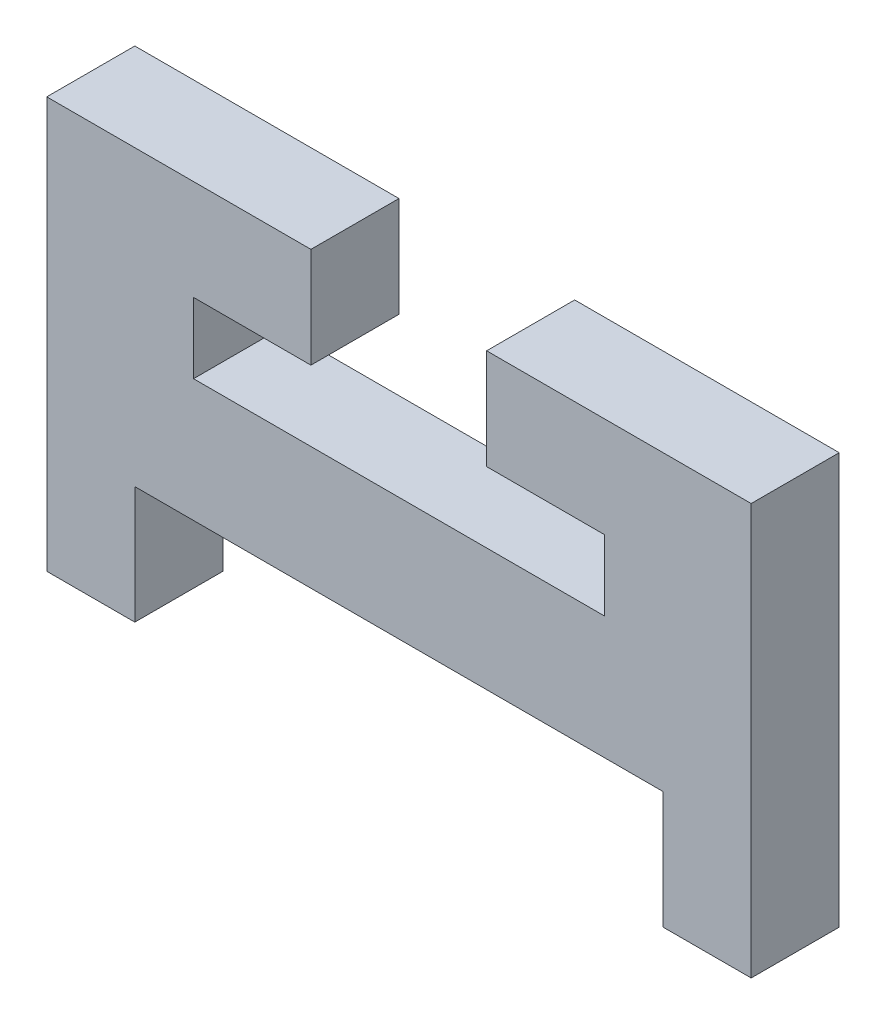
ISO-10303-21;
HEADER;
FILE_DESCRIPTION(('STEP AP214'),'2;1');
FILE_NAME('part.step','',(''),(''),'','','');
FILE_SCHEMA(('AUTOMOTIVE_DESIGN { 1 0 10303 214 1 1 1 1 }'));
ENDSEC;
DATA;
#1=APPLICATION_CONTEXT('core data for automotive mechanical design processes');
#2=APPLICATION_PROTOCOL_DEFINITION('international standard','automotive_design',2000,#1);
#3=PRODUCT_CONTEXT('',#1,'mechanical');
#4=PRODUCT('Part','Part','',(#3));
#5=PRODUCT_RELATED_PRODUCT_CATEGORY('part','',(#4));
#6=PRODUCT_DEFINITION_FORMATION('','',#4);
#7=PRODUCT_DEFINITION_CONTEXT('part definition',#1,'design');
#8=PRODUCT_DEFINITION('design','',#6,#7);
#9=PRODUCT_DEFINITION_SHAPE('','',#8);
#10=(LENGTH_UNIT() NAMED_UNIT(*) SI_UNIT(.MILLI.,.METRE.));
#11=(NAMED_UNIT(*) PLANE_ANGLE_UNIT() SI_UNIT($,.RADIAN.));
#12=(NAMED_UNIT(*) SI_UNIT($,.STERADIAN.) SOLID_ANGLE_UNIT());
#13=UNCERTAINTY_MEASURE_WITH_UNIT(LENGTH_MEASURE(1.E-05),#10,'distance_accuracy_value','');
#14=(GEOMETRIC_REPRESENTATION_CONTEXT(3) GLOBAL_UNCERTAINTY_ASSIGNED_CONTEXT((#13)) GLOBAL_UNIT_ASSIGNED_CONTEXT((#10,
#11,#12)) REPRESENTATION_CONTEXT('',''));
#15=CARTESIAN_POINT('',(0.,0.,0.));
#16=DIRECTION('',(0.,0.,1.));
#17=DIRECTION('',(1.,0.,0.));
#18=AXIS2_PLACEMENT_3D('',#15,#16,#17);
#19=CARTESIAN_POINT('',(33.6,16.0826832944775,3.));
#20=DIRECTION('',(0.,-1.,0.));
#21=DIRECTION('',(0.,0.,-1.));
#22=AXIS2_PLACEMENT_3D('',#19,#20,#21);
#23=PLANE('',#22);
#24=DIRECTION('',(-1.,0.,0.));
#25=VECTOR('',#24,1.);
#26=CARTESIAN_POINT('',(33.6,16.0826832944775,0.));
#27=LINE('',#26,#25);
#28=CARTESIAN_POINT('',(40.1,16.0826832944775,0.));
#29=VERTEX_POINT('',#28);
#30=CARTESIAN_POINT('',(26.1,16.0826832944775,0.));
#31=VERTEX_POINT('',#30);
#32=EDGE_CURVE('E109',#29,#31,#27,.T.);
#33=ORIENTED_EDGE('',*,*,#32,.T.);
#34=DIRECTION('',(0.,0.,-1.));
#35=VECTOR('',#34,1.);
#36=CARTESIAN_POINT('',(26.1,16.0826832944775,3.));
#37=LINE('',#36,#35);
#38=CARTESIAN_POINT('',(26.1,16.0826832944775,3.));
#39=VERTEX_POINT('',#38);
#40=EDGE_CURVE('E11',#39,#31,#37,.T.);
#41=ORIENTED_EDGE('',*,*,#40,.F.);
#42=DIRECTION('',(-1.,0.,0.));
#43=VECTOR('',#42,1.);
#44=CARTESIAN_POINT('',(40.1,16.0826832944775,3.));
#45=LINE('',#44,#43);
#46=CARTESIAN_POINT('',(40.1,16.0826832944775,3.));
#47=VERTEX_POINT('',#46);
#48=EDGE_CURVE('E115',#47,#39,#45,.T.);
#49=ORIENTED_EDGE('',*,*,#48,.F.);
#50=DIRECTION('',(0.,0.,-1.));
#51=VECTOR('',#50,1.);
#52=CARTESIAN_POINT('',(40.1,16.0826832944775,3.));
#53=LINE('',#52,#51);
#54=EDGE_CURVE('E173',#47,#29,#53,.T.);
#55=ORIENTED_EDGE('',*,*,#54,.T.);
#56=EDGE_LOOP('',(#33,#41,#49,#55));
#57=FACE_BOUND('',#56,.T.);
#58=ADVANCED_FACE('F33',(#57),#23,.F.);
#59=CARTESIAN_POINT('',(26.1,16.0826832944775,3.));
#60=DIRECTION('',(-1.,0.,0.));
#61=DIRECTION('',(0.,0.,1.));
#62=AXIS2_PLACEMENT_3D('',#59,#60,#61);
#63=PLANE('',#62);
#64=DIRECTION('',(0.,1.,0.));
#65=VECTOR('',#64,1.);
#66=CARTESIAN_POINT('',(26.1,16.0826832944775,0.));
#67=LINE('',#66,#65);
#68=CARTESIAN_POINT('',(26.1,18.4826832944775,0.));
#69=VERTEX_POINT('',#68);
#70=EDGE_CURVE('E178',#31,#69,#67,.T.);
#71=ORIENTED_EDGE('',*,*,#70,.T.);
#72=DIRECTION('',(0.,0.,-1.));
#73=VECTOR('',#72,1.);
#74=CARTESIAN_POINT('',(26.1,18.4826832944775,3.));
#75=LINE('',#74,#73);
#76=CARTESIAN_POINT('',(26.1,18.4826832944775,3.));
#77=VERTEX_POINT('',#76);
#78=EDGE_CURVE('E41',#77,#69,#75,.T.);
#79=ORIENTED_EDGE('',*,*,#78,.F.);
#80=DIRECTION('',(0.,1.,0.));
#81=VECTOR('',#80,1.);
#82=CARTESIAN_POINT('',(26.1,16.0826832944775,3.));
#83=LINE('',#82,#81);
#84=EDGE_CURVE('E294',#39,#77,#83,.T.);
#85=ORIENTED_EDGE('',*,*,#84,.F.);
#86=ORIENTED_EDGE('',*,*,#40,.T.);
#87=EDGE_LOOP('',(#71,#79,#85,#86));
#88=FACE_BOUND('',#87,.T.);
#89=ADVANCED_FACE('F297',(#88),#63,.F.);
#90=CARTESIAN_POINT('',(26.1,18.4826832944775,3.));
#91=DIRECTION('',(0.,1.,0.));
#92=DIRECTION('',(0.,0.,1.));
#93=AXIS2_PLACEMENT_3D('',#90,#91,#92);
#94=PLANE('',#93);
#95=DIRECTION('',(1.,0.,0.));
#96=VECTOR('',#95,1.);
#97=CARTESIAN_POINT('',(26.1,18.4826832944775,0.));
#98=LINE('',#97,#96);
#99=CARTESIAN_POINT('',(30.1,18.4826832944775,0.));
#100=VERTEX_POINT('',#99);
#101=EDGE_CURVE('E180',#69,#100,#98,.T.);
#102=ORIENTED_EDGE('',*,*,#101,.T.);
#103=DIRECTION('',(0.,0.,-1.));
#104=VECTOR('',#103,1.);
#105=CARTESIAN_POINT('',(30.1,18.4826832944775,3.));
#106=LINE('',#105,#104);
#107=CARTESIAN_POINT('',(30.1,18.4826832944775,3.));
#108=VERTEX_POINT('',#107);
#109=EDGE_CURVE('E237',#108,#100,#106,.T.);
#110=ORIENTED_EDGE('',*,*,#109,.F.);
#111=DIRECTION('',(1.,0.,0.));
#112=VECTOR('',#111,1.);
#113=CARTESIAN_POINT('',(26.1,18.4826832944775,3.));
#114=LINE('',#113,#112);
#115=EDGE_CURVE('E246',#77,#108,#114,.T.);
#116=ORIENTED_EDGE('',*,*,#115,.F.);
#117=ORIENTED_EDGE('',*,*,#78,.T.);
#118=EDGE_LOOP('',(#102,#110,#116,#117));
#119=FACE_BOUND('',#118,.T.);
#120=ADVANCED_FACE('F244',(#119),#94,.F.);
#121=CARTESIAN_POINT('',(30.1,18.4826832944775,3.));
#122=DIRECTION('',(-1.,0.,0.));
#123=DIRECTION('',(0.,0.,1.));
#124=AXIS2_PLACEMENT_3D('',#121,#122,#123);
#125=PLANE('',#124);
#126=DIRECTION('',(0.,1.,0.));
#127=VECTOR('',#126,1.);
#128=CARTESIAN_POINT('',(30.1,18.4826832944775,0.));
#129=LINE('',#128,#127);
#130=CARTESIAN_POINT('',(30.1,21.9,0.));
#131=VERTEX_POINT('',#130);
#132=EDGE_CURVE('E182',#100,#131,#129,.T.);
#133=ORIENTED_EDGE('',*,*,#132,.T.);
#134=DIRECTION('',(0.,0.,-1.));
#135=VECTOR('',#134,1.);
#136=CARTESIAN_POINT('',(30.1,21.9,3.));
#137=LINE('',#136,#135);
#138=CARTESIAN_POINT('',(30.1,21.9,3.));
#139=VERTEX_POINT('',#138);
#140=EDGE_CURVE('E234',#139,#131,#137,.T.);
#141=ORIENTED_EDGE('',*,*,#140,.F.);
#142=DIRECTION('',(0.,1.,0.));
#143=VECTOR('',#142,1.);
#144=CARTESIAN_POINT('',(30.1,18.4826832944775,3.));
#145=LINE('',#144,#143);
#146=EDGE_CURVE('E264',#108,#139,#145,.T.);
#147=ORIENTED_EDGE('',*,*,#146,.F.);
#148=ORIENTED_EDGE('',*,*,#109,.T.);
#149=EDGE_LOOP('',(#133,#141,#147,#148));
#150=FACE_BOUND('',#149,.T.);
#151=ADVANCED_FACE('F255',(#150),#125,.F.);
#152=CARTESIAN_POINT('',(30.1,21.9,3.));
#153=DIRECTION('',(0.,-1.,0.));
#154=DIRECTION('',(0.,0.,-1.));
#155=AXIS2_PLACEMENT_3D('',#152,#153,#154);
#156=PLANE('',#155);
#157=DIRECTION('',(-1.,0.,0.));
#158=VECTOR('',#157,1.);
#159=CARTESIAN_POINT('',(30.1,21.9,0.));
#160=LINE('',#159,#158);
#161=CARTESIAN_POINT('',(21.1,21.9,0.));
#162=VERTEX_POINT('',#161);
#163=EDGE_CURVE('E184',#131,#162,#160,.T.);
#164=ORIENTED_EDGE('',*,*,#163,.T.);
#165=DIRECTION('',(0.,0.,-1.));
#166=VECTOR('',#165,1.);
#167=CARTESIAN_POINT('',(21.1,21.9,3.));
#168=LINE('',#167,#166);
#169=CARTESIAN_POINT('',(21.1,21.9,3.));
#170=VERTEX_POINT('',#169);
#171=EDGE_CURVE('E231',#170,#162,#168,.T.);
#172=ORIENTED_EDGE('',*,*,#171,.F.);
#173=DIRECTION('',(-1.,0.,0.));
#174=VECTOR('',#173,1.);
#175=CARTESIAN_POINT('',(30.1,21.9,3.));
#176=LINE('',#175,#174);
#177=EDGE_CURVE('E261',#139,#170,#176,.T.);
#178=ORIENTED_EDGE('',*,*,#177,.F.);
#179=ORIENTED_EDGE('',*,*,#140,.T.);
#180=EDGE_LOOP('',(#164,#172,#178,#179));
#181=FACE_BOUND('',#180,.T.);
#182=ADVANCED_FACE('F259',(#181),#156,.F.);
#183=CARTESIAN_POINT('',(21.1,21.9,3.));
#184=DIRECTION('',(1.,0.,0.));
#185=DIRECTION('',(0.,0.,-1.));
#186=AXIS2_PLACEMENT_3D('',#183,#184,#185);
#187=PLANE('',#186);
#188=DIRECTION('',(0.,-1.,0.));
#189=VECTOR('',#188,1.);
#190=CARTESIAN_POINT('',(21.1,21.9,0.));
#191=LINE('',#190,#189);
#192=CARTESIAN_POINT('',(21.1,7.90000000000001,0.));
#193=VERTEX_POINT('',#192);
#194=EDGE_CURVE('E186',#162,#193,#191,.T.);
#195=ORIENTED_EDGE('',*,*,#194,.T.);
#196=DIRECTION('',(0.,0.,-1.));
#197=VECTOR('',#196,1.);
#198=CARTESIAN_POINT('',(21.1,7.90000000000001,3.));
#199=LINE('',#198,#197);
#200=CARTESIAN_POINT('',(21.1,7.90000000000001,3.));
#201=VERTEX_POINT('',#200);
#202=EDGE_CURVE('E228',#201,#193,#199,.T.);
#203=ORIENTED_EDGE('',*,*,#202,.F.);
#204=DIRECTION('',(0.,-1.,0.));
#205=VECTOR('',#204,1.);
#206=CARTESIAN_POINT('',(21.1,21.9,3.));
#207=LINE('',#206,#205);
#208=EDGE_CURVE('E263',#170,#201,#207,.T.);
#209=ORIENTED_EDGE('',*,*,#208,.F.);
#210=ORIENTED_EDGE('',*,*,#171,.T.);
#211=EDGE_LOOP('',(#195,#203,#209,#210));
#212=FACE_BOUND('',#211,.T.);
#213=ADVANCED_FACE('F309',(#212),#187,.F.);
#214=CARTESIAN_POINT('',(21.1,7.90000000000001,3.));
#215=DIRECTION('',(0.,1.,0.));
#216=DIRECTION('',(0.,0.,1.));
#217=AXIS2_PLACEMENT_3D('',#214,#215,#216);
#218=PLANE('',#217);
#219=DIRECTION('',(1.,0.,0.));
#220=VECTOR('',#219,1.);
#221=CARTESIAN_POINT('',(21.1,7.90000000000001,0.));
#222=LINE('',#221,#220);
#223=CARTESIAN_POINT('',(24.1,7.90000000000001,0.));
#224=VERTEX_POINT('',#223);
#225=EDGE_CURVE('E188',#193,#224,#222,.T.);
#226=ORIENTED_EDGE('',*,*,#225,.T.);
#227=DIRECTION('',(0.,0.,-1.));
#228=VECTOR('',#227,1.);
#229=CARTESIAN_POINT('',(24.1,7.90000000000001,3.));
#230=LINE('',#229,#228);
#231=CARTESIAN_POINT('',(24.1,7.90000000000001,3.));
#232=VERTEX_POINT('',#231);
#233=EDGE_CURVE('E225',#232,#224,#230,.T.);
#234=ORIENTED_EDGE('',*,*,#233,.F.);
#235=DIRECTION('',(1.,0.,0.));
#236=VECTOR('',#235,1.);
#237=CARTESIAN_POINT('',(21.1,7.90000000000001,3.));
#238=LINE('',#237,#236);
#239=EDGE_CURVE('E266',#201,#232,#238,.T.);
#240=ORIENTED_EDGE('',*,*,#239,.F.);
#241=ORIENTED_EDGE('',*,*,#202,.T.);
#242=EDGE_LOOP('',(#226,#234,#240,#241));
#243=FACE_BOUND('',#242,.T.);
#244=ADVANCED_FACE('F312',(#243),#218,.F.);
#245=CARTESIAN_POINT('',(24.1,7.90000000000001,3.));
#246=DIRECTION('',(-1.,0.,0.));
#247=DIRECTION('',(0.,0.,1.));
#248=AXIS2_PLACEMENT_3D('',#245,#246,#247);
#249=PLANE('',#248);
#250=DIRECTION('',(0.,1.,0.));
#251=VECTOR('',#250,1.);
#252=CARTESIAN_POINT('',(24.1,7.90000000000001,0.));
#253=LINE('',#252,#251);
#254=CARTESIAN_POINT('',(24.1,11.9,0.));
#255=VERTEX_POINT('',#254);
#256=EDGE_CURVE('E190',#224,#255,#253,.T.);
#257=ORIENTED_EDGE('',*,*,#256,.T.);
#258=DIRECTION('',(0.,0.,-1.));
#259=VECTOR('',#258,1.);
#260=CARTESIAN_POINT('',(24.1,11.9,3.));
#261=LINE('',#260,#259);
#262=CARTESIAN_POINT('',(24.1,11.9,3.));
#263=VERTEX_POINT('',#262);
#264=EDGE_CURVE('E222',#263,#255,#261,.T.);
#265=ORIENTED_EDGE('',*,*,#264,.F.);
#266=DIRECTION('',(0.,1.,0.));
#267=VECTOR('',#266,1.);
#268=CARTESIAN_POINT('',(24.1,7.90000000000001,3.));
#269=LINE('',#268,#267);
#270=EDGE_CURVE('E272',#232,#263,#269,.T.);
#271=ORIENTED_EDGE('',*,*,#270,.F.);
#272=ORIENTED_EDGE('',*,*,#233,.T.);
#273=EDGE_LOOP('',(#257,#265,#271,#272));
#274=FACE_BOUND('',#273,.T.);
#275=ADVANCED_FACE('F316',(#274),#249,.F.);
#276=CARTESIAN_POINT('',(24.1,11.9,3.));
#277=DIRECTION('',(0.,1.,0.));
#278=DIRECTION('',(0.,0.,1.));
#279=AXIS2_PLACEMENT_3D('',#276,#277,#278);
#280=PLANE('',#279);
#281=DIRECTION('',(1.,0.,0.));
#282=VECTOR('',#281,1.);
#283=CARTESIAN_POINT('',(24.1,11.9,0.));
#284=LINE('',#283,#282);
#285=CARTESIAN_POINT('',(42.1,11.9,0.));
#286=VERTEX_POINT('',#285);
#287=EDGE_CURVE('E192',#255,#286,#284,.T.);
#288=ORIENTED_EDGE('',*,*,#287,.T.);
#289=DIRECTION('',(0.,0.,-1.));
#290=VECTOR('',#289,1.);
#291=CARTESIAN_POINT('',(42.1,11.9,3.));
#292=LINE('',#291,#290);
#293=CARTESIAN_POINT('',(42.1,11.9,3.));
#294=VERTEX_POINT('',#293);
#295=EDGE_CURVE('E219',#294,#286,#292,.T.);
#296=ORIENTED_EDGE('',*,*,#295,.F.);
#297=DIRECTION('',(1.,0.,0.));
#298=VECTOR('',#297,1.);
#299=CARTESIAN_POINT('',(24.1,11.9,3.));
#300=LINE('',#299,#298);
#301=EDGE_CURVE('E274',#263,#294,#300,.T.);
#302=ORIENTED_EDGE('',*,*,#301,.F.);
#303=ORIENTED_EDGE('',*,*,#264,.T.);
#304=EDGE_LOOP('',(#288,#296,#302,#303));
#305=FACE_BOUND('',#304,.T.);
#306=ADVANCED_FACE('F320',(#305),#280,.F.);
#307=CARTESIAN_POINT('',(42.1,11.9,3.));
#308=DIRECTION('',(1.,0.,0.));
#309=DIRECTION('',(0.,0.,-1.));
#310=AXIS2_PLACEMENT_3D('',#307,#308,#309);
#311=PLANE('',#310);
#312=DIRECTION('',(0.,-1.,0.));
#313=VECTOR('',#312,1.);
#314=CARTESIAN_POINT('',(42.1,11.9,0.));
#315=LINE('',#314,#313);
#316=CARTESIAN_POINT('',(42.1,7.90000000000001,0.));
#317=VERTEX_POINT('',#316);
#318=EDGE_CURVE('E194',#286,#317,#315,.T.);
#319=ORIENTED_EDGE('',*,*,#318,.T.);
#320=DIRECTION('',(0.,0.,-1.));
#321=VECTOR('',#320,1.);
#322=CARTESIAN_POINT('',(42.1,7.90000000000001,3.));
#323=LINE('',#322,#321);
#324=CARTESIAN_POINT('',(42.1,7.90000000000001,3.));
#325=VERTEX_POINT('',#324);
#326=EDGE_CURVE('E216',#325,#317,#323,.T.);
#327=ORIENTED_EDGE('',*,*,#326,.F.);
#328=DIRECTION('',(0.,-1.,0.));
#329=VECTOR('',#328,1.);
#330=CARTESIAN_POINT('',(42.1,11.9,3.));
#331=LINE('',#330,#329);
#332=EDGE_CURVE('E276',#294,#325,#331,.T.);
#333=ORIENTED_EDGE('',*,*,#332,.F.);
#334=ORIENTED_EDGE('',*,*,#295,.T.);
#335=EDGE_LOOP('',(#319,#327,#333,#334));
#336=FACE_BOUND('',#335,.T.);
#337=ADVANCED_FACE('F324',(#336),#311,.F.);
#338=CARTESIAN_POINT('',(42.1,7.90000000000001,3.));
#339=DIRECTION('',(0.,1.,0.));
#340=DIRECTION('',(0.,0.,1.));
#341=AXIS2_PLACEMENT_3D('',#338,#339,#340);
#342=PLANE('',#341);
#343=DIRECTION('',(1.,0.,0.));
#344=VECTOR('',#343,1.);
#345=CARTESIAN_POINT('',(42.1,7.90000000000001,0.));
#346=LINE('',#345,#344);
#347=CARTESIAN_POINT('',(45.1,7.90000000000001,0.));
#348=VERTEX_POINT('',#347);
#349=EDGE_CURVE('E196',#317,#348,#346,.T.);
#350=ORIENTED_EDGE('',*,*,#349,.T.);
#351=DIRECTION('',(0.,0.,-1.));
#352=VECTOR('',#351,1.);
#353=CARTESIAN_POINT('',(45.1,7.90000000000001,3.));
#354=LINE('',#353,#352);
#355=CARTESIAN_POINT('',(45.1,7.90000000000001,3.));
#356=VERTEX_POINT('',#355);
#357=EDGE_CURVE('E213',#356,#348,#354,.T.);
#358=ORIENTED_EDGE('',*,*,#357,.F.);
#359=DIRECTION('',(1.,0.,0.));
#360=VECTOR('',#359,1.);
#361=CARTESIAN_POINT('',(42.1,7.90000000000001,3.));
#362=LINE('',#361,#360);
#363=EDGE_CURVE('E278',#325,#356,#362,.T.);
#364=ORIENTED_EDGE('',*,*,#363,.F.);
#365=ORIENTED_EDGE('',*,*,#326,.T.);
#366=EDGE_LOOP('',(#350,#358,#364,#365));
#367=FACE_BOUND('',#366,.T.);
#368=ADVANCED_FACE('F328',(#367),#342,.F.);
#369=CARTESIAN_POINT('',(45.1,7.90000000000001,3.));
#370=DIRECTION('',(-1.,0.,0.));
#371=DIRECTION('',(0.,0.,1.));
#372=AXIS2_PLACEMENT_3D('',#369,#370,#371);
#373=PLANE('',#372);
#374=DIRECTION('',(0.,1.,0.));
#375=VECTOR('',#374,1.);
#376=CARTESIAN_POINT('',(45.1,7.90000000000001,0.));
#377=LINE('',#376,#375);
#378=CARTESIAN_POINT('',(45.1,21.9,0.));
#379=VERTEX_POINT('',#378);
#380=EDGE_CURVE('E198',#348,#379,#377,.T.);
#381=ORIENTED_EDGE('',*,*,#380,.T.);
#382=DIRECTION('',(0.,0.,-1.));
#383=VECTOR('',#382,1.);
#384=CARTESIAN_POINT('',(45.1,21.9,3.));
#385=LINE('',#384,#383);
#386=CARTESIAN_POINT('',(45.1,21.9,3.));
#387=VERTEX_POINT('',#386);
#388=EDGE_CURVE('E210',#387,#379,#385,.T.);
#389=ORIENTED_EDGE('',*,*,#388,.F.);
#390=DIRECTION('',(0.,1.,0.));
#391=VECTOR('',#390,1.);
#392=CARTESIAN_POINT('',(45.1,7.90000000000001,3.));
#393=LINE('',#392,#391);
#394=EDGE_CURVE('E280',#356,#387,#393,.T.);
#395=ORIENTED_EDGE('',*,*,#394,.F.);
#396=ORIENTED_EDGE('',*,*,#357,.T.);
#397=EDGE_LOOP('',(#381,#389,#395,#396));
#398=FACE_BOUND('',#397,.T.);
#399=ADVANCED_FACE('F286',(#398),#373,.F.);
#400=CARTESIAN_POINT('',(45.1,21.9,3.));
#401=DIRECTION('',(0.,-1.,0.));
#402=DIRECTION('',(0.,0.,-1.));
#403=AXIS2_PLACEMENT_3D('',#400,#401,#402);
#404=PLANE('',#403);
#405=DIRECTION('',(-1.,0.,0.));
#406=VECTOR('',#405,1.);
#407=CARTESIAN_POINT('',(45.1,21.9,0.));
#408=LINE('',#407,#406);
#409=CARTESIAN_POINT('',(36.0863854020223,21.9,0.));
#410=VERTEX_POINT('',#409);
#411=EDGE_CURVE('E200',#379,#410,#408,.T.);
#412=ORIENTED_EDGE('',*,*,#411,.T.);
#413=DIRECTION('',(0.,0.,-1.));
#414=VECTOR('',#413,1.);
#415=CARTESIAN_POINT('',(36.0863854020223,21.9,3.));
#416=LINE('',#415,#414);
#417=CARTESIAN_POINT('',(36.0863854020223,21.9,3.));
#418=VERTEX_POINT('',#417);
#419=EDGE_CURVE('E168',#418,#410,#416,.T.);
#420=ORIENTED_EDGE('',*,*,#419,.F.);
#421=DIRECTION('',(-1.,0.,0.));
#422=VECTOR('',#421,1.);
#423=CARTESIAN_POINT('',(45.1,21.9,3.));
#424=LINE('',#423,#422);
#425=EDGE_CURVE('E159',#387,#418,#424,.T.);
#426=ORIENTED_EDGE('',*,*,#425,.F.);
#427=ORIENTED_EDGE('',*,*,#388,.T.);
#428=EDGE_LOOP('',(#412,#420,#426,#427));
#429=FACE_BOUND('',#428,.T.);
#430=ADVANCED_FACE('F290',(#429),#404,.F.);
#431=CARTESIAN_POINT('',(36.0863854020223,21.9,3.));
#432=DIRECTION('',(1.,0.,0.));
#433=DIRECTION('',(0.,0.,-1.));
#434=AXIS2_PLACEMENT_3D('',#431,#432,#433);
#435=PLANE('',#434);
#436=DIRECTION('',(0.,-1.,0.));
#437=VECTOR('',#436,1.);
#438=CARTESIAN_POINT('',(36.0863854020223,21.9,0.));
#439=LINE('',#438,#437);
#440=CARTESIAN_POINT('',(36.0863854020223,18.4826832944775,0.));
#441=VERTEX_POINT('',#440);
#442=EDGE_CURVE('E167',#410,#441,#439,.T.);
#443=ORIENTED_EDGE('',*,*,#442,.T.);
#444=DIRECTION('',(0.,0.,-1.));
#445=VECTOR('',#444,1.);
#446=CARTESIAN_POINT('',(36.0863854020223,18.4826832944775,3.));
#447=LINE('',#446,#445);
#448=CARTESIAN_POINT('',(36.0863854020223,18.4826832944775,3.));
#449=VERTEX_POINT('',#448);
#450=EDGE_CURVE('E164',#449,#441,#447,.T.);
#451=ORIENTED_EDGE('',*,*,#450,.F.);
#452=DIRECTION('',(0.,-1.,0.));
#453=VECTOR('',#452,1.);
#454=CARTESIAN_POINT('',(36.0863854020223,21.9,3.));
#455=LINE('',#454,#453);
#456=EDGE_CURVE('E153',#418,#449,#455,.T.);
#457=ORIENTED_EDGE('',*,*,#456,.F.);
#458=ORIENTED_EDGE('',*,*,#419,.T.);
#459=EDGE_LOOP('',(#443,#451,#457,#458));
#460=FACE_BOUND('',#459,.T.);
#461=ADVANCED_FACE('F165',(#460),#435,.F.);
#462=CARTESIAN_POINT('',(36.0863854020223,18.4826832944775,3.));
#463=DIRECTION('',(0.,1.,0.));
#464=DIRECTION('',(0.,0.,1.));
#465=AXIS2_PLACEMENT_3D('',#462,#463,#464);
#466=PLANE('',#465);
#467=DIRECTION('',(1.,0.,0.));
#468=VECTOR('',#467,1.);
#469=CARTESIAN_POINT('',(36.0863854020223,18.4826832944775,0.));
#470=LINE('',#469,#468);
#471=CARTESIAN_POINT('',(40.1,18.4826832944775,0.));
#472=VERTEX_POINT('',#471);
#473=EDGE_CURVE('E102',#441,#472,#470,.T.);
#474=ORIENTED_EDGE('',*,*,#473,.T.);
#475=DIRECTION('',(0.,0.,-1.));
#476=VECTOR('',#475,1.);
#477=CARTESIAN_POINT('',(40.1,18.4826832944775,3.));
#478=LINE('',#477,#476);
#479=CARTESIAN_POINT('',(40.1,18.4826832944775,3.));
#480=VERTEX_POINT('',#479);
#481=EDGE_CURVE('E169',#480,#472,#478,.T.);
#482=ORIENTED_EDGE('',*,*,#481,.F.);
#483=DIRECTION('',(1.,0.,0.));
#484=VECTOR('',#483,1.);
#485=CARTESIAN_POINT('',(36.0863854020223,18.4826832944775,3.));
#486=LINE('',#485,#484);
#487=EDGE_CURVE('E157',#449,#480,#486,.T.);
#488=ORIENTED_EDGE('',*,*,#487,.F.);
#489=ORIENTED_EDGE('',*,*,#450,.T.);
#490=EDGE_LOOP('',(#474,#482,#488,#489));
#491=FACE_BOUND('',#490,.T.);
#492=ADVANCED_FACE('F171',(#491),#466,.F.);
#493=CARTESIAN_POINT('',(40.1,18.4826832944775,3.));
#494=DIRECTION('',(1.,0.,0.));
#495=DIRECTION('',(0.,0.,-1.));
#496=AXIS2_PLACEMENT_3D('',#493,#494,#495);
#497=PLANE('',#496);
#498=DIRECTION('',(0.,-1.,0.));
#499=VECTOR('',#498,1.);
#500=CARTESIAN_POINT('',(40.1,18.4826832944775,0.));
#501=LINE('',#500,#499);
#502=EDGE_CURVE('E204',#472,#29,#501,.T.);
#503=ORIENTED_EDGE('',*,*,#502,.T.);
#504=ORIENTED_EDGE('',*,*,#54,.F.);
#505=DIRECTION('',(0.,-1.,0.));
#506=VECTOR('',#505,1.);
#507=CARTESIAN_POINT('',(40.1,18.4826832944775,3.));
#508=LINE('',#507,#506);
#509=EDGE_CURVE('E49',#480,#47,#508,.T.);
#510=ORIENTED_EDGE('',*,*,#509,.F.);
#511=ORIENTED_EDGE('',*,*,#481,.T.);
#512=EDGE_LOOP('',(#503,#504,#510,#511));
#513=FACE_BOUND('',#512,.T.);
#514=ADVANCED_FACE('F292',(#513),#497,.F.);
#515=CARTESIAN_POINT('',(0.,0.,3.));
#516=DIRECTION('',(0.,0.,-1.));
#517=DIRECTION('',(-1.,0.,0.));
#518=AXIS2_PLACEMENT_3D('',#515,#516,#517);
#519=PLANE('',#518);
#520=ORIENTED_EDGE('',*,*,#48,.T.);
#521=ORIENTED_EDGE('',*,*,#84,.T.);
#522=ORIENTED_EDGE('',*,*,#115,.T.);
#523=ORIENTED_EDGE('',*,*,#146,.T.);
#524=ORIENTED_EDGE('',*,*,#177,.T.);
#525=ORIENTED_EDGE('',*,*,#208,.T.);
#526=ORIENTED_EDGE('',*,*,#239,.T.);
#527=ORIENTED_EDGE('',*,*,#270,.T.);
#528=ORIENTED_EDGE('',*,*,#301,.T.);
#529=ORIENTED_EDGE('',*,*,#332,.T.);
#530=ORIENTED_EDGE('',*,*,#363,.T.);
#531=ORIENTED_EDGE('',*,*,#394,.T.);
#532=ORIENTED_EDGE('',*,*,#425,.T.);
#533=ORIENTED_EDGE('',*,*,#456,.T.);
#534=ORIENTED_EDGE('',*,*,#487,.T.);
#535=ORIENTED_EDGE('',*,*,#509,.T.);
#536=EDGE_LOOP('',(#520,#521,#522,#523,#524,#525,#526,#527,#528,#529,#530,#531,#532,#533,#534,#535));
#537=FACE_BOUND('',#536,.T.);
#538=ADVANCED_FACE('F155',(#537),#519,.F.);
#539=CARTESIAN_POINT('',(0.,0.,0.));
#540=DIRECTION('',(0.,0.,-1.));
#541=DIRECTION('',(-1.,0.,0.));
#542=AXIS2_PLACEMENT_3D('',#539,#540,#541);
#543=PLANE('',#542);
#544=ORIENTED_EDGE('',*,*,#32,.F.);
#545=ORIENTED_EDGE('',*,*,#502,.F.);
#546=ORIENTED_EDGE('',*,*,#473,.F.);
#547=ORIENTED_EDGE('',*,*,#442,.F.);
#548=ORIENTED_EDGE('',*,*,#411,.F.);
#549=ORIENTED_EDGE('',*,*,#380,.F.);
#550=ORIENTED_EDGE('',*,*,#349,.F.);
#551=ORIENTED_EDGE('',*,*,#318,.F.);
#552=ORIENTED_EDGE('',*,*,#287,.F.);
#553=ORIENTED_EDGE('',*,*,#256,.F.);
#554=ORIENTED_EDGE('',*,*,#225,.F.);
#555=ORIENTED_EDGE('',*,*,#194,.F.);
#556=ORIENTED_EDGE('',*,*,#163,.F.);
#557=ORIENTED_EDGE('',*,*,#132,.F.);
#558=ORIENTED_EDGE('',*,*,#101,.F.);
#559=ORIENTED_EDGE('',*,*,#70,.F.);
#560=EDGE_LOOP('',(#544,#545,#546,#547,#548,#549,#550,#551,#552,#553,#554,#555,#556,#557,#558,#559));
#561=FACE_BOUND('',#560,.T.);
#562=ADVANCED_FACE('F250',(#561),#543,.T.);
#563=CLOSED_SHELL('',(#58,#89,#120,#151,#182,#213,#244,#275,#306,#337,#368,#399,#430,#461,#492,
#514,#538,#562));
#564=MANIFOLD_SOLID_BREP('B2',#563);
#565=ADVANCED_BREP_SHAPE_REPRESENTATION('',(#18,#564),#14);
#566=SHAPE_DEFINITION_REPRESENTATION(#9,#565);
ENDSEC;
END-ISO-10303-21;
